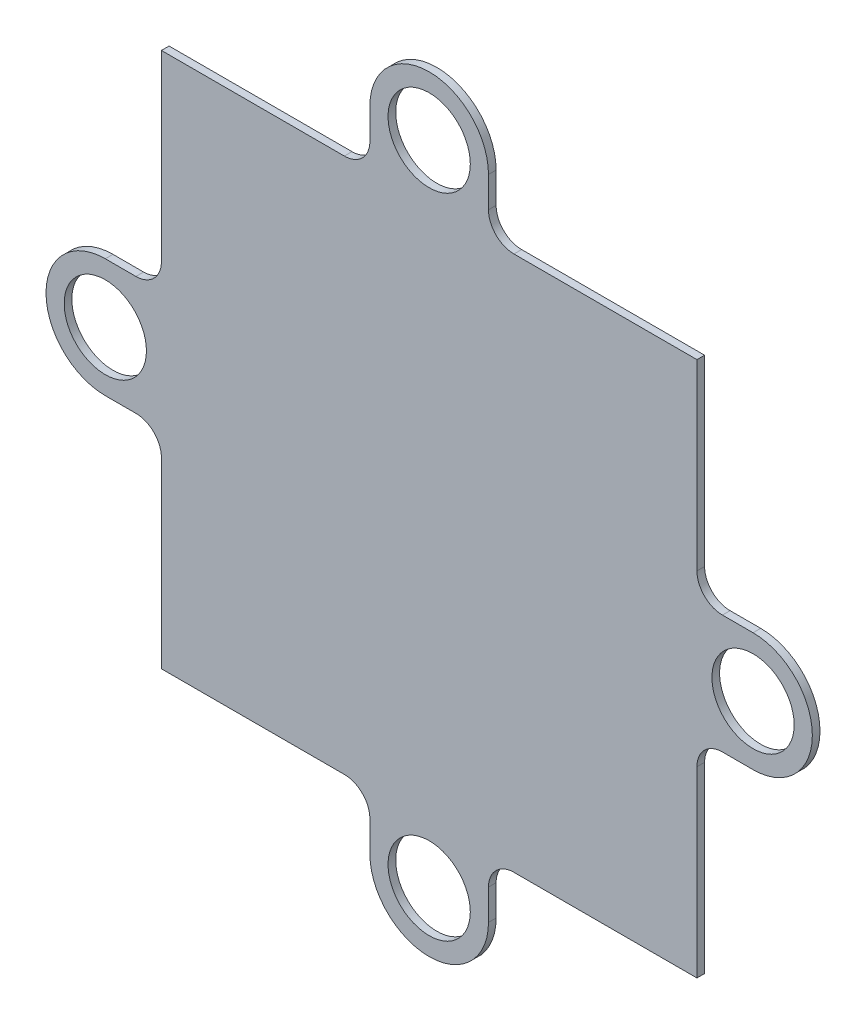
ISO-10303-21;
HEADER;
FILE_DESCRIPTION(('STEP AP214'),'2;1');
FILE_NAME('part.step','',(''),(''),'','','');
FILE_SCHEMA(('AUTOMOTIVE_DESIGN { 1 0 10303 214 1 1 1 1 }'));
ENDSEC;
DATA;
#1=APPLICATION_CONTEXT('core data for automotive mechanical design processes');
#2=APPLICATION_PROTOCOL_DEFINITION('international standard','automotive_design',2000,#1);
#3=PRODUCT_CONTEXT('',#1,'mechanical');
#4=PRODUCT('Part','Part','',(#3));
#5=PRODUCT_RELATED_PRODUCT_CATEGORY('part','',(#4));
#6=PRODUCT_DEFINITION_FORMATION('','',#4);
#7=PRODUCT_DEFINITION_CONTEXT('part definition',#1,'design');
#8=PRODUCT_DEFINITION('design','',#6,#7);
#9=PRODUCT_DEFINITION_SHAPE('','',#8);
#10=(LENGTH_UNIT() NAMED_UNIT(*) SI_UNIT(.MILLI.,.METRE.));
#11=(NAMED_UNIT(*) PLANE_ANGLE_UNIT() SI_UNIT($,.RADIAN.));
#12=(NAMED_UNIT(*) SI_UNIT($,.STERADIAN.) SOLID_ANGLE_UNIT());
#13=UNCERTAINTY_MEASURE_WITH_UNIT(LENGTH_MEASURE(1.E-05),#10,'distance_accuracy_value','');
#14=(GEOMETRIC_REPRESENTATION_CONTEXT(3) GLOBAL_UNCERTAINTY_ASSIGNED_CONTEXT((#13)) GLOBAL_UNIT_ASSIGNED_CONTEXT((#10,
#11,#12)) REPRESENTATION_CONTEXT('',''));
#15=CARTESIAN_POINT('',(0.,0.,0.));
#16=DIRECTION('',(0.,0.,1.));
#17=DIRECTION('',(1.,0.,0.));
#18=AXIS2_PLACEMENT_3D('',#15,#16,#17);
#19=CARTESIAN_POINT('',(0.,-4.64999999999974,0.6));
#20=DIRECTION('',(0.,1.,0.));
#21=DIRECTION('',(0.,0.,1.));
#22=AXIS2_PLACEMENT_3D('',#19,#20,#21);
#23=PLANE('',#22);
#24=DIRECTION('',(1.,0.,0.));
#25=VECTOR('',#24,1.);
#26=CARTESIAN_POINT('',(0.,-4.64999999999974,0.));
#27=LINE('',#26,#25);
#28=CARTESIAN_POINT('',(-25.4000000000001,-4.64999999999974,0.));
#29=VERTEX_POINT('',#28);
#30=CARTESIAN_POINT('',(-23.0000000000001,-4.64999999999974,0.));
#31=VERTEX_POINT('',#30);
#32=EDGE_CURVE('E282',#29,#31,#27,.T.);
#33=ORIENTED_EDGE('',*,*,#32,.T.);
#34=DIRECTION('',(0.,0.,-1.));
#35=VECTOR('',#34,1.);
#36=CARTESIAN_POINT('',(-23.0000000000001,-4.64999999999974,0.6));
#37=LINE('',#36,#35);
#38=CARTESIAN_POINT('',(-23.0000000000001,-4.64999999999974,0.6));
#39=VERTEX_POINT('',#38);
#40=EDGE_CURVE('E11',#39,#31,#37,.T.);
#41=ORIENTED_EDGE('',*,*,#40,.F.);
#42=DIRECTION('',(1.,0.,0.));
#43=VECTOR('',#42,1.);
#44=CARTESIAN_POINT('',(0.,-4.64999999999974,0.6));
#45=LINE('',#44,#43);
#46=CARTESIAN_POINT('',(-25.4000000000001,-4.64999999999974,0.6));
#47=VERTEX_POINT('',#46);
#48=EDGE_CURVE('E488',#47,#39,#45,.T.);
#49=ORIENTED_EDGE('',*,*,#48,.F.);
#50=DIRECTION('',(0.,0.,-1.));
#51=VECTOR('',#50,1.);
#52=CARTESIAN_POINT('',(-25.4000000000001,-4.64999999999974,0.6));
#53=LINE('',#52,#51);
#54=EDGE_CURVE('E262',#47,#29,#53,.T.);
#55=ORIENTED_EDGE('',*,*,#54,.T.);
#56=EDGE_LOOP('',(#33,#41,#49,#55));
#57=FACE_BOUND('',#56,.T.);
#58=ADVANCED_FACE('F45',(#57),#23,.F.);
#59=CARTESIAN_POINT('',(-23.0000000000001,-6.64999999999976,0.6));
#60=DIRECTION('',(0.,0.,-1.));
#61=DIRECTION('',(-1.,0.,0.));
#62=AXIS2_PLACEMENT_3D('',#59,#60,#61);
#63=CYLINDRICAL_SURFACE('',#62,2.00000000000001);
#64=CARTESIAN_POINT('',(-23.0000000000001,-6.64999999999976,0.));
#65=DIRECTION('',(0.,0.,1.));
#66=DIRECTION('',(1.,0.,0.));
#67=AXIS2_PLACEMENT_3D('',#64,#65,#66);
#68=CIRCLE('',#67,2.00000000000001);
#69=CARTESIAN_POINT('',(-21.0000000000001,-6.6499999999998,0.));
#70=VERTEX_POINT('',#69);
#71=EDGE_CURVE('E286',#31,#70,#68,.F.);
#72=ORIENTED_EDGE('',*,*,#71,.T.);
#73=DIRECTION('',(0.,0.,-1.));
#74=VECTOR('',#73,1.);
#75=CARTESIAN_POINT('',(-21.0000000000001,-6.6499999999998,0.6));
#76=LINE('',#75,#74);
#77=CARTESIAN_POINT('',(-21.0000000000001,-6.6499999999998,0.6));
#78=VERTEX_POINT('',#77);
#79=EDGE_CURVE('E55',#78,#70,#76,.T.);
#80=ORIENTED_EDGE('',*,*,#79,.F.);
#81=CARTESIAN_POINT('',(-23.0000000000001,-6.64999999999976,0.6));
#82=DIRECTION('',(0.,0.,1.));
#83=DIRECTION('',(1.,0.,0.));
#84=AXIS2_PLACEMENT_3D('',#81,#82,#83);
#85=CIRCLE('',#84,2.00000000000001);
#86=EDGE_CURVE('E162',#39,#78,#85,.F.);
#87=ORIENTED_EDGE('',*,*,#86,.F.);
#88=ORIENTED_EDGE('',*,*,#40,.T.);
#89=EDGE_LOOP('',(#72,#80,#87,#88));
#90=FACE_BOUND('',#89,.T.);
#91=ADVANCED_FACE('F468',(#90),#63,.F.);
#92=CARTESIAN_POINT('',(-21.0000000000001,-1.01544788837666E-13,0.6));
#93=DIRECTION('',(-1.,0.,0.));
#94=DIRECTION('',(0.,-1.,0.));
#95=AXIS2_PLACEMENT_3D('',#92,#93,#94);
#96=PLANE('',#95);
#97=DIRECTION('',(0.,1.,0.));
#98=VECTOR('',#97,1.);
#99=CARTESIAN_POINT('',(-21.0000000000001,-1.01544788837666E-13,0.));
#100=LINE('',#99,#98);
#101=CARTESIAN_POINT('',(-21.,-21.,0.));
#102=VERTEX_POINT('',#101);
#103=EDGE_CURVE('E290',#102,#70,#100,.T.);
#104=ORIENTED_EDGE('',*,*,#103,.F.);
#105=DIRECTION('',(0.,0.,-1.));
#106=VECTOR('',#105,1.);
#107=CARTESIAN_POINT('',(-21.,-21.,0.6));
#108=LINE('',#107,#106);
#109=CARTESIAN_POINT('',(-21.,-21.,0.6));
#110=VERTEX_POINT('',#109);
#111=EDGE_CURVE('E459',#110,#102,#108,.T.);
#112=ORIENTED_EDGE('',*,*,#111,.F.);
#113=DIRECTION('',(0.,1.,0.));
#114=VECTOR('',#113,1.);
#115=CARTESIAN_POINT('',(-21.0000000000001,-1.01544788837666E-13,0.6));
#116=LINE('',#115,#114);
#117=EDGE_CURVE('E467',#110,#78,#116,.T.);
#118=ORIENTED_EDGE('',*,*,#117,.T.);
#119=ORIENTED_EDGE('',*,*,#79,.T.);
#120=EDGE_LOOP('',(#104,#112,#118,#119));
#121=FACE_BOUND('',#120,.T.);
#122=ADVANCED_FACE('F465',(#121),#96,.T.);
#123=CARTESIAN_POINT('',(1.827806199078E-13,-20.9999999999998,0.6));
#124=DIRECTION('',(0.,1.,0.));
#125=DIRECTION('',(-1.,0.,0.));
#126=AXIS2_PLACEMENT_3D('',#123,#124,#125);
#127=PLANE('',#126);
#128=DIRECTION('',(1.,0.,0.));
#129=VECTOR('',#128,1.);
#130=CARTESIAN_POINT('',(1.827806199078E-13,-20.9999999999998,0.));
#131=LINE('',#130,#129);
#132=CARTESIAN_POINT('',(-6.65000000000012,-20.9999999999999,0.));
#133=VERTEX_POINT('',#132);
#134=EDGE_CURVE('E294',#102,#133,#131,.T.);
#135=ORIENTED_EDGE('',*,*,#134,.T.);
#136=DIRECTION('',(0.,0.,-1.));
#137=VECTOR('',#136,1.);
#138=CARTESIAN_POINT('',(-6.65000000000012,-20.9999999999999,0.6));
#139=LINE('',#138,#137);
#140=CARTESIAN_POINT('',(-6.65000000000012,-20.9999999999999,0.6));
#141=VERTEX_POINT('',#140);
#142=EDGE_CURVE('E456',#141,#133,#139,.T.);
#143=ORIENTED_EDGE('',*,*,#142,.F.);
#144=DIRECTION('',(1.,0.,0.));
#145=VECTOR('',#144,1.);
#146=CARTESIAN_POINT('',(1.827806199078E-13,-20.9999999999998,0.6));
#147=LINE('',#146,#145);
#148=EDGE_CURVE('E480',#110,#141,#147,.T.);
#149=ORIENTED_EDGE('',*,*,#148,.F.);
#150=ORIENTED_EDGE('',*,*,#111,.T.);
#151=EDGE_LOOP('',(#135,#143,#149,#150));
#152=FACE_BOUND('',#151,.T.);
#153=ADVANCED_FACE('F477',(#152),#127,.F.);
#154=CARTESIAN_POINT('',(-6.65000000000008,-22.9999999999999,0.6));
#155=DIRECTION('',(0.,0.,-1.));
#156=DIRECTION('',(-1.,0.,0.));
#157=AXIS2_PLACEMENT_3D('',#154,#155,#156);
#158=CYLINDRICAL_SURFACE('',#157,2.);
#159=CARTESIAN_POINT('',(-6.65000000000008,-22.9999999999999,0.));
#160=DIRECTION('',(0.,0.,1.));
#161=DIRECTION('',(1.,0.,0.));
#162=AXIS2_PLACEMENT_3D('',#159,#160,#161);
#163=CIRCLE('',#162,2.);
#164=CARTESIAN_POINT('',(-4.65000000000009,-22.9999999999999,0.));
#165=VERTEX_POINT('',#164);
#166=EDGE_CURVE('E298',#165,#133,#163,.T.);
#167=ORIENTED_EDGE('',*,*,#166,.F.);
#168=DIRECTION('',(0.,0.,-1.));
#169=VECTOR('',#168,1.);
#170=CARTESIAN_POINT('',(-4.65000000000009,-22.9999999999999,0.6));
#171=LINE('',#170,#169);
#172=CARTESIAN_POINT('',(-4.65000000000009,-22.9999999999999,0.6));
#173=VERTEX_POINT('',#172);
#174=EDGE_CURVE('E453',#173,#165,#171,.T.);
#175=ORIENTED_EDGE('',*,*,#174,.F.);
#176=CARTESIAN_POINT('',(-6.65000000000008,-22.9999999999999,0.6));
#177=DIRECTION('',(0.,0.,1.));
#178=DIRECTION('',(1.,0.,0.));
#179=AXIS2_PLACEMENT_3D('',#176,#177,#178);
#180=CIRCLE('',#179,2.);
#181=EDGE_CURVE('E483',#173,#141,#180,.T.);
#182=ORIENTED_EDGE('',*,*,#181,.T.);
#183=ORIENTED_EDGE('',*,*,#142,.T.);
#184=EDGE_LOOP('',(#167,#175,#182,#183));
#185=FACE_BOUND('',#184,.T.);
#186=ADVANCED_FACE('F841',(#185),#158,.F.);
#187=CARTESIAN_POINT('',(-4.65000000000009,0.,0.6));
#188=DIRECTION('',(-1.,0.,0.));
#189=DIRECTION('',(0.,0.,1.));
#190=AXIS2_PLACEMENT_3D('',#187,#188,#189);
#191=PLANE('',#190);
#192=DIRECTION('',(0.,1.,0.));
#193=VECTOR('',#192,1.);
#194=CARTESIAN_POINT('',(-4.65000000000009,0.,0.));
#195=LINE('',#194,#193);
#196=CARTESIAN_POINT('',(-4.65000000000009,-25.4,0.));
#197=VERTEX_POINT('',#196);
#198=EDGE_CURVE('E302',#197,#165,#195,.T.);
#199=ORIENTED_EDGE('',*,*,#198,.F.);
#200=DIRECTION('',(0.,0.,-1.));
#201=VECTOR('',#200,1.);
#202=CARTESIAN_POINT('',(-4.65000000000009,-25.4,0.6));
#203=LINE('',#202,#201);
#204=CARTESIAN_POINT('',(-4.65000000000009,-25.4,0.6));
#205=VERTEX_POINT('',#204);
#206=EDGE_CURVE('E450',#205,#197,#203,.T.);
#207=ORIENTED_EDGE('',*,*,#206,.F.);
#208=DIRECTION('',(0.,1.,0.));
#209=VECTOR('',#208,1.);
#210=CARTESIAN_POINT('',(-4.65000000000009,0.,0.6));
#211=LINE('',#210,#209);
#212=EDGE_CURVE('E494',#205,#173,#211,.T.);
#213=ORIENTED_EDGE('',*,*,#212,.T.);
#214=ORIENTED_EDGE('',*,*,#174,.T.);
#215=EDGE_LOOP('',(#199,#207,#213,#214));
#216=FACE_BOUND('',#215,.T.);
#217=ADVANCED_FACE('F832',(#216),#191,.T.);
#218=CARTESIAN_POINT('',(0.,-25.4,0.6));
#219=DIRECTION('',(0.,0.,-1.));
#220=DIRECTION('',(-1.,0.,0.));
#221=AXIS2_PLACEMENT_3D('',#218,#219,#220);
#222=CYLINDRICAL_SURFACE('',#221,4.65);
#223=CARTESIAN_POINT('',(0.,-25.4,0.));
#224=DIRECTION('',(0.,0.,1.));
#225=DIRECTION('',(1.,0.,0.));
#226=AXIS2_PLACEMENT_3D('',#223,#224,#225);
#227=CIRCLE('',#226,4.65);
#228=CARTESIAN_POINT('',(4.64999999999991,-25.4,0.));
#229=VERTEX_POINT('',#228);
#230=EDGE_CURVE('E306',#197,#229,#227,.T.);
#231=ORIENTED_EDGE('',*,*,#230,.T.);
#232=DIRECTION('',(0.,0.,-1.));
#233=VECTOR('',#232,1.);
#234=CARTESIAN_POINT('',(4.64999999999991,-25.4,0.6));
#235=LINE('',#234,#233);
#236=CARTESIAN_POINT('',(4.64999999999991,-25.4,0.6));
#237=VERTEX_POINT('',#236);
#238=EDGE_CURVE('E446',#237,#229,#235,.T.);
#239=ORIENTED_EDGE('',*,*,#238,.F.);
#240=CARTESIAN_POINT('',(0.,-25.4,0.6));
#241=DIRECTION('',(0.,0.,1.));
#242=DIRECTION('',(1.,0.,0.));
#243=AXIS2_PLACEMENT_3D('',#240,#241,#242);
#244=CIRCLE('',#243,4.65);
#245=EDGE_CURVE('E498',#205,#237,#244,.T.);
#246=ORIENTED_EDGE('',*,*,#245,.F.);
#247=ORIENTED_EDGE('',*,*,#206,.T.);
#248=EDGE_LOOP('',(#231,#239,#246,#247));
#249=FACE_BOUND('',#248,.T.);
#250=ADVANCED_FACE('F823',(#249),#222,.T.);
#251=CARTESIAN_POINT('',(4.64999999999991,0.,0.6));
#252=DIRECTION('',(-1.,0.,0.));
#253=DIRECTION('',(0.,0.,1.));
#254=AXIS2_PLACEMENT_3D('',#251,#252,#253);
#255=PLANE('',#254);
#256=DIRECTION('',(0.,1.,0.));
#257=VECTOR('',#256,1.);
#258=CARTESIAN_POINT('',(4.64999999999991,0.,0.));
#259=LINE('',#258,#257);
#260=CARTESIAN_POINT('',(4.64999999999991,-22.9999999999999,0.));
#261=VERTEX_POINT('',#260);
#262=EDGE_CURVE('E309',#229,#261,#259,.T.);
#263=ORIENTED_EDGE('',*,*,#262,.T.);
#264=DIRECTION('',(0.,0.,-1.));
#265=VECTOR('',#264,1.);
#266=CARTESIAN_POINT('',(4.64999999999991,-22.9999999999999,0.6));
#267=LINE('',#266,#265);
#268=CARTESIAN_POINT('',(4.64999999999991,-22.9999999999999,0.6));
#269=VERTEX_POINT('',#268);
#270=EDGE_CURVE('E442',#269,#261,#267,.T.);
#271=ORIENTED_EDGE('',*,*,#270,.F.);
#272=DIRECTION('',(0.,1.,0.));
#273=VECTOR('',#272,1.);
#274=CARTESIAN_POINT('',(4.64999999999991,0.,0.6));
#275=LINE('',#274,#273);
#276=EDGE_CURVE('E501',#237,#269,#275,.T.);
#277=ORIENTED_EDGE('',*,*,#276,.F.);
#278=ORIENTED_EDGE('',*,*,#238,.T.);
#279=EDGE_LOOP('',(#263,#271,#277,#278));
#280=FACE_BOUND('',#279,.T.);
#281=ADVANCED_FACE('F814',(#280),#255,.F.);
#282=CARTESIAN_POINT('',(6.6499999999999,-22.9999999999999,0.6));
#283=DIRECTION('',(0.,0.,-1.));
#284=DIRECTION('',(-1.,0.,0.));
#285=AXIS2_PLACEMENT_3D('',#282,#283,#284);
#286=CYLINDRICAL_SURFACE('',#285,2.);
#287=CARTESIAN_POINT('',(6.6499999999999,-22.9999999999999,0.));
#288=DIRECTION('',(0.,0.,1.));
#289=DIRECTION('',(1.,0.,0.));
#290=AXIS2_PLACEMENT_3D('',#287,#288,#289);
#291=CIRCLE('',#290,2.);
#292=CARTESIAN_POINT('',(6.64999999999994,-20.9999999999999,0.));
#293=VERTEX_POINT('',#292);
#294=EDGE_CURVE('E312',#261,#293,#291,.F.);
#295=ORIENTED_EDGE('',*,*,#294,.T.);
#296=DIRECTION('',(0.,0.,-1.));
#297=VECTOR('',#296,1.);
#298=CARTESIAN_POINT('',(6.64999999999994,-20.9999999999999,0.6));
#299=LINE('',#298,#297);
#300=CARTESIAN_POINT('',(6.64999999999994,-20.9999999999999,0.6));
#301=VERTEX_POINT('',#300);
#302=EDGE_CURVE('E438',#301,#293,#299,.T.);
#303=ORIENTED_EDGE('',*,*,#302,.F.);
#304=CARTESIAN_POINT('',(6.6499999999999,-22.9999999999999,0.6));
#305=DIRECTION('',(0.,0.,1.));
#306=DIRECTION('',(1.,0.,0.));
#307=AXIS2_PLACEMENT_3D('',#304,#305,#306);
#308=CIRCLE('',#307,2.);
#309=EDGE_CURVE('E504',#269,#301,#308,.F.);
#310=ORIENTED_EDGE('',*,*,#309,.F.);
#311=ORIENTED_EDGE('',*,*,#270,.T.);
#312=EDGE_LOOP('',(#295,#303,#310,#311));
#313=FACE_BOUND('',#312,.T.);
#314=ADVANCED_FACE('F805',(#313),#286,.F.);
#315=CARTESIAN_POINT('',(0.,-20.9999999999999,0.6));
#316=DIRECTION('',(0.,1.,0.));
#317=DIRECTION('',(0.,0.,1.));
#318=AXIS2_PLACEMENT_3D('',#315,#316,#317);
#319=PLANE('',#318);
#320=DIRECTION('',(1.,0.,0.));
#321=VECTOR('',#320,1.);
#322=CARTESIAN_POINT('',(0.,-20.9999999999999,0.));
#323=LINE('',#322,#321);
#324=CARTESIAN_POINT('',(21.,-21.,0.));
#325=VERTEX_POINT('',#324);
#326=EDGE_CURVE('E315',#293,#325,#323,.T.);
#327=ORIENTED_EDGE('',*,*,#326,.T.);
#328=DIRECTION('',(0.,0.,-1.));
#329=VECTOR('',#328,1.);
#330=CARTESIAN_POINT('',(21.,-21.,0.6));
#331=LINE('',#330,#329);
#332=CARTESIAN_POINT('',(21.,-21.,0.6));
#333=VERTEX_POINT('',#332);
#334=EDGE_CURVE('E434',#333,#325,#331,.T.);
#335=ORIENTED_EDGE('',*,*,#334,.F.);
#336=DIRECTION('',(1.,0.,0.));
#337=VECTOR('',#336,1.);
#338=CARTESIAN_POINT('',(0.,-20.9999999999999,0.6));
#339=LINE('',#338,#337);
#340=EDGE_CURVE('E507',#301,#333,#339,.T.);
#341=ORIENTED_EDGE('',*,*,#340,.F.);
#342=ORIENTED_EDGE('',*,*,#302,.T.);
#343=EDGE_LOOP('',(#327,#335,#341,#342));
#344=FACE_BOUND('',#343,.T.);
#345=ADVANCED_FACE('F796',(#344),#319,.F.);
#346=CARTESIAN_POINT('',(21.,0.,0.6));
#347=DIRECTION('',(-1.,0.,0.));
#348=DIRECTION('',(0.,-1.,0.));
#349=AXIS2_PLACEMENT_3D('',#346,#347,#348);
#350=PLANE('',#349);
#351=DIRECTION('',(0.,1.,0.));
#352=VECTOR('',#351,1.);
#353=CARTESIAN_POINT('',(21.,0.,0.));
#354=LINE('',#353,#352);
#355=CARTESIAN_POINT('',(21.,-6.6500000000001,0.));
#356=VERTEX_POINT('',#355);
#357=EDGE_CURVE('E318',#325,#356,#354,.T.);
#358=ORIENTED_EDGE('',*,*,#357,.T.);
#359=DIRECTION('',(0.,0.,-1.));
#360=VECTOR('',#359,1.);
#361=CARTESIAN_POINT('',(21.,-6.6500000000001,0.6));
#362=LINE('',#361,#360);
#363=CARTESIAN_POINT('',(21.,-6.6500000000001,0.6));
#364=VERTEX_POINT('',#363);
#365=EDGE_CURVE('E431',#364,#356,#362,.T.);
#366=ORIENTED_EDGE('',*,*,#365,.F.);
#367=DIRECTION('',(0.,1.,0.));
#368=VECTOR('',#367,1.);
#369=CARTESIAN_POINT('',(21.,0.,0.6));
#370=LINE('',#369,#368);
#371=EDGE_CURVE('E510',#333,#364,#370,.T.);
#372=ORIENTED_EDGE('',*,*,#371,.F.);
#373=ORIENTED_EDGE('',*,*,#334,.T.);
#374=EDGE_LOOP('',(#358,#366,#372,#373));
#375=FACE_BOUND('',#374,.T.);
#376=ADVANCED_FACE('F787',(#375),#350,.F.);
#377=CARTESIAN_POINT('',(23.,-6.65000000000009,0.6));
#378=DIRECTION('',(0.,0.,-1.));
#379=DIRECTION('',(-1.,0.,0.));
#380=AXIS2_PLACEMENT_3D('',#377,#378,#379);
#381=CYLINDRICAL_SURFACE('',#380,2.);
#382=CARTESIAN_POINT('',(23.,-6.65000000000009,0.));
#383=DIRECTION('',(0.,0.,1.));
#384=DIRECTION('',(1.,0.,0.));
#385=AXIS2_PLACEMENT_3D('',#382,#383,#384);
#386=CIRCLE('',#385,2.);
#387=CARTESIAN_POINT('',(23.,-4.6500000000001,0.));
#388=VERTEX_POINT('',#387);
#389=EDGE_CURVE('E322',#388,#356,#386,.T.);
#390=ORIENTED_EDGE('',*,*,#389,.F.);
#391=DIRECTION('',(0.,0.,-1.));
#392=VECTOR('',#391,1.);
#393=CARTESIAN_POINT('',(23.,-4.6500000000001,0.6));
#394=LINE('',#393,#392);
#395=CARTESIAN_POINT('',(23.,-4.6500000000001,0.6));
#396=VERTEX_POINT('',#395);
#397=EDGE_CURVE('E428',#396,#388,#394,.T.);
#398=ORIENTED_EDGE('',*,*,#397,.F.);
#399=CARTESIAN_POINT('',(23.,-6.65000000000009,0.6));
#400=DIRECTION('',(0.,0.,1.));
#401=DIRECTION('',(1.,0.,0.));
#402=AXIS2_PLACEMENT_3D('',#399,#400,#401);
#403=CIRCLE('',#402,2.);
#404=EDGE_CURVE('E513',#396,#364,#403,.T.);
#405=ORIENTED_EDGE('',*,*,#404,.T.);
#406=ORIENTED_EDGE('',*,*,#365,.T.);
#407=EDGE_LOOP('',(#390,#398,#405,#406));
#408=FACE_BOUND('',#407,.T.);
#409=ADVANCED_FACE('F778',(#408),#381,.F.);
#410=CARTESIAN_POINT('',(0.,-4.6500000000001,0.6));
#411=DIRECTION('',(0.,-1.,0.));
#412=DIRECTION('',(0.,0.,-1.));
#413=AXIS2_PLACEMENT_3D('',#410,#411,#412);
#414=PLANE('',#413);
#415=DIRECTION('',(-1.,0.,0.));
#416=VECTOR('',#415,1.);
#417=CARTESIAN_POINT('',(0.,-4.6500000000001,0.));
#418=LINE('',#417,#416);
#419=CARTESIAN_POINT('',(25.4000000000001,-4.6500000000001,0.));
#420=VERTEX_POINT('',#419);
#421=EDGE_CURVE('E326',#420,#388,#418,.T.);
#422=ORIENTED_EDGE('',*,*,#421,.F.);
#423=DIRECTION('',(0.,0.,-1.));
#424=VECTOR('',#423,1.);
#425=CARTESIAN_POINT('',(25.4000000000001,-4.6500000000001,0.6));
#426=LINE('',#425,#424);
#427=CARTESIAN_POINT('',(25.4000000000001,-4.6500000000001,0.6));
#428=VERTEX_POINT('',#427);
#429=EDGE_CURVE('E425',#428,#420,#426,.T.);
#430=ORIENTED_EDGE('',*,*,#429,.F.);
#431=DIRECTION('',(-1.,0.,0.));
#432=VECTOR('',#431,1.);
#433=CARTESIAN_POINT('',(0.,-4.6500000000001,0.6));
#434=LINE('',#433,#432);
#435=EDGE_CURVE('E517',#428,#396,#434,.T.);
#436=ORIENTED_EDGE('',*,*,#435,.T.);
#437=ORIENTED_EDGE('',*,*,#397,.T.);
#438=EDGE_LOOP('',(#422,#430,#436,#437));
#439=FACE_BOUND('',#438,.T.);
#440=ADVANCED_FACE('F769',(#439),#414,.T.);
#441=CARTESIAN_POINT('',(25.4000000000001,0.,0.6));
#442=DIRECTION('',(0.,0.,-1.));
#443=DIRECTION('',(-1.,0.,0.));
#444=AXIS2_PLACEMENT_3D('',#441,#442,#443);
#445=CYLINDRICAL_SURFACE('',#444,4.65);
#446=CARTESIAN_POINT('',(25.4000000000001,0.,0.));
#447=DIRECTION('',(0.,0.,1.));
#448=DIRECTION('',(1.,0.,0.));
#449=AXIS2_PLACEMENT_3D('',#446,#447,#448);
#450=CIRCLE('',#449,4.65);
#451=CARTESIAN_POINT('',(25.4000000000001,4.6499999999999,0.));
#452=VERTEX_POINT('',#451);
#453=EDGE_CURVE('E330',#420,#452,#450,.T.);
#454=ORIENTED_EDGE('',*,*,#453,.T.);
#455=DIRECTION('',(0.,0.,-1.));
#456=VECTOR('',#455,1.);
#457=CARTESIAN_POINT('',(25.4000000000001,4.6499999999999,0.6));
#458=LINE('',#457,#456);
#459=CARTESIAN_POINT('',(25.4000000000001,4.6499999999999,0.6));
#460=VERTEX_POINT('',#459);
#461=EDGE_CURVE('E421',#460,#452,#458,.T.);
#462=ORIENTED_EDGE('',*,*,#461,.F.);
#463=CARTESIAN_POINT('',(25.4000000000001,0.,0.6));
#464=DIRECTION('',(0.,0.,1.));
#465=DIRECTION('',(1.,0.,0.));
#466=AXIS2_PLACEMENT_3D('',#463,#464,#465);
#467=CIRCLE('',#466,4.65);
#468=EDGE_CURVE('E521',#428,#460,#467,.T.);
#469=ORIENTED_EDGE('',*,*,#468,.F.);
#470=ORIENTED_EDGE('',*,*,#429,.T.);
#471=EDGE_LOOP('',(#454,#462,#469,#470));
#472=FACE_BOUND('',#471,.T.);
#473=ADVANCED_FACE('F760',(#472),#445,.T.);
#474=CARTESIAN_POINT('',(0.,4.6499999999999,0.6));
#475=DIRECTION('',(0.,-1.,0.));
#476=DIRECTION('',(0.,0.,-1.));
#477=AXIS2_PLACEMENT_3D('',#474,#475,#476);
#478=PLANE('',#477);
#479=DIRECTION('',(-1.,0.,0.));
#480=VECTOR('',#479,1.);
#481=CARTESIAN_POINT('',(0.,4.6499999999999,0.));
#482=LINE('',#481,#480);
#483=CARTESIAN_POINT('',(23.,4.6499999999999,0.));
#484=VERTEX_POINT('',#483);
#485=EDGE_CURVE('E333',#452,#484,#482,.T.);
#486=ORIENTED_EDGE('',*,*,#485,.T.);
#487=DIRECTION('',(0.,0.,-1.));
#488=VECTOR('',#487,1.);
#489=CARTESIAN_POINT('',(23.,4.6499999999999,0.6));
#490=LINE('',#489,#488);
#491=CARTESIAN_POINT('',(23.,4.6499999999999,0.6));
#492=VERTEX_POINT('',#491);
#493=EDGE_CURVE('E417',#492,#484,#490,.T.);
#494=ORIENTED_EDGE('',*,*,#493,.F.);
#495=DIRECTION('',(-1.,0.,0.));
#496=VECTOR('',#495,1.);
#497=CARTESIAN_POINT('',(0.,4.6499999999999,0.6));
#498=LINE('',#497,#496);
#499=EDGE_CURVE('E524',#460,#492,#498,.T.);
#500=ORIENTED_EDGE('',*,*,#499,.F.);
#501=ORIENTED_EDGE('',*,*,#461,.T.);
#502=EDGE_LOOP('',(#486,#494,#500,#501));
#503=FACE_BOUND('',#502,.T.);
#504=ADVANCED_FACE('F751',(#503),#478,.F.);
#505=CARTESIAN_POINT('',(23.,6.64999999999991,0.6));
#506=DIRECTION('',(0.,0.,-1.));
#507=DIRECTION('',(-1.,0.,0.));
#508=AXIS2_PLACEMENT_3D('',#505,#506,#507);
#509=CYLINDRICAL_SURFACE('',#508,2.00000000000001);
#510=CARTESIAN_POINT('',(23.,6.64999999999991,0.));
#511=DIRECTION('',(0.,0.,1.));
#512=DIRECTION('',(1.,0.,0.));
#513=AXIS2_PLACEMENT_3D('',#510,#511,#512);
#514=CIRCLE('',#513,2.00000000000001);
#515=CARTESIAN_POINT('',(21.,6.64999999999993,0.));
#516=VERTEX_POINT('',#515);
#517=EDGE_CURVE('E336',#484,#516,#514,.F.);
#518=ORIENTED_EDGE('',*,*,#517,.T.);
#519=DIRECTION('',(0.,0.,-1.));
#520=VECTOR('',#519,1.);
#521=CARTESIAN_POINT('',(21.,6.64999999999993,0.6));
#522=LINE('',#521,#520);
#523=CARTESIAN_POINT('',(21.,6.64999999999993,0.6));
#524=VERTEX_POINT('',#523);
#525=EDGE_CURVE('E413',#524,#516,#522,.T.);
#526=ORIENTED_EDGE('',*,*,#525,.F.);
#527=CARTESIAN_POINT('',(23.,6.64999999999991,0.6));
#528=DIRECTION('',(0.,0.,1.));
#529=DIRECTION('',(1.,0.,0.));
#530=AXIS2_PLACEMENT_3D('',#527,#528,#529);
#531=CIRCLE('',#530,2.00000000000001);
#532=EDGE_CURVE('E527',#492,#524,#531,.F.);
#533=ORIENTED_EDGE('',*,*,#532,.F.);
#534=ORIENTED_EDGE('',*,*,#493,.T.);
#535=EDGE_LOOP('',(#518,#526,#533,#534));
#536=FACE_BOUND('',#535,.T.);
#537=ADVANCED_FACE('F742',(#536),#509,.F.);
#538=CARTESIAN_POINT('',(21.,0.,0.6));
#539=DIRECTION('',(-1.,0.,0.));
#540=DIRECTION('',(0.,0.,1.));
#541=AXIS2_PLACEMENT_3D('',#538,#539,#540);
#542=PLANE('',#541);
#543=DIRECTION('',(0.,1.,0.));
#544=VECTOR('',#543,1.);
#545=CARTESIAN_POINT('',(21.,0.,0.));
#546=LINE('',#545,#544);
#547=CARTESIAN_POINT('',(21.,21.,0.));
#548=VERTEX_POINT('',#547);
#549=EDGE_CURVE('E339',#516,#548,#546,.T.);
#550=ORIENTED_EDGE('',*,*,#549,.T.);
#551=DIRECTION('',(0.,0.,-1.));
#552=VECTOR('',#551,1.);
#553=CARTESIAN_POINT('',(21.,21.,0.6));
#554=LINE('',#553,#552);
#555=CARTESIAN_POINT('',(21.,21.,0.6));
#556=VERTEX_POINT('',#555);
#557=EDGE_CURVE('E410',#556,#548,#554,.T.);
#558=ORIENTED_EDGE('',*,*,#557,.F.);
#559=DIRECTION('',(0.,1.,0.));
#560=VECTOR('',#559,1.);
#561=CARTESIAN_POINT('',(21.,0.,0.6));
#562=LINE('',#561,#560);
#563=EDGE_CURVE('E530',#524,#556,#562,.T.);
#564=ORIENTED_EDGE('',*,*,#563,.F.);
#565=ORIENTED_EDGE('',*,*,#525,.T.);
#566=EDGE_LOOP('',(#550,#558,#564,#565));
#567=FACE_BOUND('',#566,.T.);
#568=ADVANCED_FACE('F733',(#567),#542,.F.);
#569=CARTESIAN_POINT('',(0.,21.,0.6));
#570=DIRECTION('',(0.,1.,0.));
#571=DIRECTION('',(0.,0.,1.));
#572=AXIS2_PLACEMENT_3D('',#569,#570,#571);
#573=PLANE('',#572);
#574=DIRECTION('',(1.,0.,0.));
#575=VECTOR('',#574,1.);
#576=CARTESIAN_POINT('',(0.,21.,0.));
#577=LINE('',#576,#575);
#578=CARTESIAN_POINT('',(6.65000000000001,21.,0.));
#579=VERTEX_POINT('',#578);
#580=EDGE_CURVE('E343',#579,#548,#577,.T.);
#581=ORIENTED_EDGE('',*,*,#580,.F.);
#582=DIRECTION('',(0.,0.,-1.));
#583=VECTOR('',#582,1.);
#584=CARTESIAN_POINT('',(6.65000000000001,21.,0.6));
#585=LINE('',#584,#583);
#586=CARTESIAN_POINT('',(6.65000000000001,21.,0.6));
#587=VERTEX_POINT('',#586);
#588=EDGE_CURVE('E407',#587,#579,#585,.T.);
#589=ORIENTED_EDGE('',*,*,#588,.F.);
#590=DIRECTION('',(1.,0.,0.));
#591=VECTOR('',#590,1.);
#592=CARTESIAN_POINT('',(0.,21.,0.6));
#593=LINE('',#592,#591);
#594=EDGE_CURVE('E533',#587,#556,#593,.T.);
#595=ORIENTED_EDGE('',*,*,#594,.T.);
#596=ORIENTED_EDGE('',*,*,#557,.T.);
#597=EDGE_LOOP('',(#581,#589,#595,#596));
#598=FACE_BOUND('',#597,.T.);
#599=ADVANCED_FACE('F724',(#598),#573,.T.);
#600=CARTESIAN_POINT('',(6.65000000000001,23.,0.6));
#601=DIRECTION('',(0.,0.,-1.));
#602=DIRECTION('',(-1.,0.,0.));
#603=AXIS2_PLACEMENT_3D('',#600,#601,#602);
#604=CYLINDRICAL_SURFACE('',#603,2.);
#605=CARTESIAN_POINT('',(6.65000000000001,23.,0.));
#606=DIRECTION('',(0.,0.,1.));
#607=DIRECTION('',(1.,0.,0.));
#608=AXIS2_PLACEMENT_3D('',#605,#606,#607);
#609=CIRCLE('',#608,2.);
#610=CARTESIAN_POINT('',(4.65,23.,0.));
#611=VERTEX_POINT('',#610);
#612=EDGE_CURVE('E347',#611,#579,#609,.T.);
#613=ORIENTED_EDGE('',*,*,#612,.F.);
#614=DIRECTION('',(0.,0.,-1.));
#615=VECTOR('',#614,1.);
#616=CARTESIAN_POINT('',(4.65,23.,0.6));
#617=LINE('',#616,#615);
#618=CARTESIAN_POINT('',(4.65,23.,0.6));
#619=VERTEX_POINT('',#618);
#620=EDGE_CURVE('E404',#619,#611,#617,.T.);
#621=ORIENTED_EDGE('',*,*,#620,.F.);
#622=CARTESIAN_POINT('',(6.65000000000001,23.,0.6));
#623=DIRECTION('',(0.,0.,1.));
#624=DIRECTION('',(1.,0.,0.));
#625=AXIS2_PLACEMENT_3D('',#622,#623,#624);
#626=CIRCLE('',#625,2.);
#627=EDGE_CURVE('E537',#619,#587,#626,.T.);
#628=ORIENTED_EDGE('',*,*,#627,.T.);
#629=ORIENTED_EDGE('',*,*,#588,.T.);
#630=EDGE_LOOP('',(#613,#621,#628,#629));
#631=FACE_BOUND('',#630,.T.);
#632=ADVANCED_FACE('F715',(#631),#604,.F.);
#633=CARTESIAN_POINT('',(4.65,0.,0.6));
#634=DIRECTION('',(1.,0.,0.));
#635=DIRECTION('',(0.,0.,-1.));
#636=AXIS2_PLACEMENT_3D('',#633,#634,#635);
#637=PLANE('',#636);
#638=DIRECTION('',(0.,-1.,0.));
#639=VECTOR('',#638,1.);
#640=CARTESIAN_POINT('',(4.65,0.,0.));
#641=LINE('',#640,#639);
#642=CARTESIAN_POINT('',(4.65,25.4000000000001,0.));
#643=VERTEX_POINT('',#642);
#644=EDGE_CURVE('E351',#643,#611,#641,.T.);
#645=ORIENTED_EDGE('',*,*,#644,.F.);
#646=DIRECTION('',(0.,0.,-1.));
#647=VECTOR('',#646,1.);
#648=CARTESIAN_POINT('',(4.65,25.4000000000001,0.6));
#649=LINE('',#648,#647);
#650=CARTESIAN_POINT('',(4.65,25.4000000000001,0.6));
#651=VERTEX_POINT('',#650);
#652=EDGE_CURVE('E401',#651,#643,#649,.T.);
#653=ORIENTED_EDGE('',*,*,#652,.F.);
#654=DIRECTION('',(0.,-1.,0.));
#655=VECTOR('',#654,1.);
#656=CARTESIAN_POINT('',(4.65,0.,0.6));
#657=LINE('',#656,#655);
#658=EDGE_CURVE('E541',#651,#619,#657,.T.);
#659=ORIENTED_EDGE('',*,*,#658,.T.);
#660=ORIENTED_EDGE('',*,*,#620,.T.);
#661=EDGE_LOOP('',(#645,#653,#659,#660));
#662=FACE_BOUND('',#661,.T.);
#663=ADVANCED_FACE('F706',(#662),#637,.T.);
#664=CARTESIAN_POINT('',(0.,25.4000000000001,0.6));
#665=DIRECTION('',(0.,0.,-1.));
#666=DIRECTION('',(-1.,0.,0.));
#667=AXIS2_PLACEMENT_3D('',#664,#665,#666);
#668=CYLINDRICAL_SURFACE('',#667,4.65);
#669=CARTESIAN_POINT('',(0.,25.4000000000001,0.));
#670=DIRECTION('',(0.,0.,1.));
#671=DIRECTION('',(1.,0.,0.));
#672=AXIS2_PLACEMENT_3D('',#669,#670,#671);
#673=CIRCLE('',#672,4.65);
#674=CARTESIAN_POINT('',(-4.65,25.4000000000001,0.));
#675=VERTEX_POINT('',#674);
#676=EDGE_CURVE('E355',#643,#675,#673,.T.);
#677=ORIENTED_EDGE('',*,*,#676,.T.);
#678=DIRECTION('',(0.,0.,-1.));
#679=VECTOR('',#678,1.);
#680=CARTESIAN_POINT('',(-4.65,25.4000000000001,0.6));
#681=LINE('',#680,#679);
#682=CARTESIAN_POINT('',(-4.65,25.4000000000001,0.6));
#683=VERTEX_POINT('',#682);
#684=EDGE_CURVE('E397',#683,#675,#681,.T.);
#685=ORIENTED_EDGE('',*,*,#684,.F.);
#686=CARTESIAN_POINT('',(0.,25.4000000000001,0.6));
#687=DIRECTION('',(0.,0.,1.));
#688=DIRECTION('',(1.,0.,0.));
#689=AXIS2_PLACEMENT_3D('',#686,#687,#688);
#690=CIRCLE('',#689,4.65);
#691=EDGE_CURVE('E545',#651,#683,#690,.T.);
#692=ORIENTED_EDGE('',*,*,#691,.F.);
#693=ORIENTED_EDGE('',*,*,#652,.T.);
#694=EDGE_LOOP('',(#677,#685,#692,#693));
#695=FACE_BOUND('',#694,.T.);
#696=ADVANCED_FACE('F697',(#695),#668,.T.);
#697=CARTESIAN_POINT('',(-4.65,0.,0.6));
#698=DIRECTION('',(1.,0.,0.));
#699=DIRECTION('',(0.,0.,-1.));
#700=AXIS2_PLACEMENT_3D('',#697,#698,#699);
#701=PLANE('',#700);
#702=DIRECTION('',(0.,-1.,0.));
#703=VECTOR('',#702,1.);
#704=CARTESIAN_POINT('',(-4.65,0.,0.));
#705=LINE('',#704,#703);
#706=CARTESIAN_POINT('',(-4.65,23.,0.));
#707=VERTEX_POINT('',#706);
#708=EDGE_CURVE('E358',#675,#707,#705,.T.);
#709=ORIENTED_EDGE('',*,*,#708,.T.);
#710=DIRECTION('',(0.,0.,-1.));
#711=VECTOR('',#710,1.);
#712=CARTESIAN_POINT('',(-4.65,23.,0.6));
#713=LINE('',#712,#711);
#714=CARTESIAN_POINT('',(-4.65,23.,0.6));
#715=VERTEX_POINT('',#714);
#716=EDGE_CURVE('E393',#715,#707,#713,.T.);
#717=ORIENTED_EDGE('',*,*,#716,.F.);
#718=DIRECTION('',(0.,-1.,0.));
#719=VECTOR('',#718,1.);
#720=CARTESIAN_POINT('',(-4.65,0.,0.6));
#721=LINE('',#720,#719);
#722=EDGE_CURVE('E548',#683,#715,#721,.T.);
#723=ORIENTED_EDGE('',*,*,#722,.F.);
#724=ORIENTED_EDGE('',*,*,#684,.T.);
#725=EDGE_LOOP('',(#709,#717,#723,#724));
#726=FACE_BOUND('',#725,.T.);
#727=ADVANCED_FACE('F688',(#726),#701,.F.);
#728=CARTESIAN_POINT('',(-6.65,23.,0.6));
#729=DIRECTION('',(0.,0.,-1.));
#730=DIRECTION('',(-1.,0.,0.));
#731=AXIS2_PLACEMENT_3D('',#728,#729,#730);
#732=CYLINDRICAL_SURFACE('',#731,2.);
#733=CARTESIAN_POINT('',(-6.65,23.,0.));
#734=DIRECTION('',(0.,0.,1.));
#735=DIRECTION('',(1.,0.,0.));
#736=AXIS2_PLACEMENT_3D('',#733,#734,#735);
#737=CIRCLE('',#736,2.);
#738=CARTESIAN_POINT('',(-6.65,21.,0.));
#739=VERTEX_POINT('',#738);
#740=EDGE_CURVE('E361',#707,#739,#737,.F.);
#741=ORIENTED_EDGE('',*,*,#740,.T.);
#742=DIRECTION('',(0.,0.,-1.));
#743=VECTOR('',#742,1.);
#744=CARTESIAN_POINT('',(-6.65,21.,0.6));
#745=LINE('',#744,#743);
#746=CARTESIAN_POINT('',(-6.65,21.,0.6));
#747=VERTEX_POINT('',#746);
#748=EDGE_CURVE('E390',#747,#739,#745,.T.);
#749=ORIENTED_EDGE('',*,*,#748,.F.);
#750=CARTESIAN_POINT('',(-6.65,23.,0.6));
#751=DIRECTION('',(0.,0.,1.));
#752=DIRECTION('',(1.,0.,0.));
#753=AXIS2_PLACEMENT_3D('',#750,#751,#752);
#754=CIRCLE('',#753,2.);
#755=EDGE_CURVE('E551',#715,#747,#754,.F.);
#756=ORIENTED_EDGE('',*,*,#755,.F.);
#757=ORIENTED_EDGE('',*,*,#716,.T.);
#758=EDGE_LOOP('',(#741,#749,#756,#757));
#759=FACE_BOUND('',#758,.T.);
#760=ADVANCED_FACE('F679',(#759),#732,.F.);
#761=CARTESIAN_POINT('',(0.,21.,0.6));
#762=DIRECTION('',(0.,1.,0.));
#763=DIRECTION('',(0.,0.,1.));
#764=AXIS2_PLACEMENT_3D('',#761,#762,#763);
#765=PLANE('',#764);
#766=DIRECTION('',(1.,0.,0.));
#767=VECTOR('',#766,1.);
#768=CARTESIAN_POINT('',(0.,21.,0.));
#769=LINE('',#768,#767);
#770=CARTESIAN_POINT('',(-21.,21.,0.));
#771=VERTEX_POINT('',#770);
#772=EDGE_CURVE('E365',#771,#739,#769,.T.);
#773=ORIENTED_EDGE('',*,*,#772,.F.);
#774=DIRECTION('',(0.,0.,-1.));
#775=VECTOR('',#774,1.);
#776=CARTESIAN_POINT('',(-21.,21.,0.6));
#777=LINE('',#776,#775);
#778=CARTESIAN_POINT('',(-21.,21.,0.6));
#779=VERTEX_POINT('',#778);
#780=EDGE_CURVE('E387',#779,#771,#777,.T.);
#781=ORIENTED_EDGE('',*,*,#780,.F.);
#782=DIRECTION('',(1.,0.,0.));
#783=VECTOR('',#782,1.);
#784=CARTESIAN_POINT('',(0.,21.,0.6));
#785=LINE('',#784,#783);
#786=EDGE_CURVE('E554',#779,#747,#785,.T.);
#787=ORIENTED_EDGE('',*,*,#786,.T.);
#788=ORIENTED_EDGE('',*,*,#748,.T.);
#789=EDGE_LOOP('',(#773,#781,#787,#788));
#790=FACE_BOUND('',#789,.T.);
#791=ADVANCED_FACE('F670',(#790),#765,.T.);
#792=CARTESIAN_POINT('',(-20.9999999999999,-1.01544788837668E-13,0.6));
#793=DIRECTION('',(-1.,0.,0.));
#794=DIRECTION('',(0.,-1.,0.));
#795=AXIS2_PLACEMENT_3D('',#792,#793,#794);
#796=PLANE('',#795);
#797=DIRECTION('',(0.,1.,0.));
#798=VECTOR('',#797,1.);
#799=CARTESIAN_POINT('',(-20.9999999999999,-1.01544788837668E-13,0.));
#800=LINE('',#799,#798);
#801=CARTESIAN_POINT('',(-20.9999999999999,6.65000000000023,0.));
#802=VERTEX_POINT('',#801);
#803=EDGE_CURVE('E369',#802,#771,#800,.T.);
#804=ORIENTED_EDGE('',*,*,#803,.F.);
#805=DIRECTION('',(0.,0.,-1.));
#806=VECTOR('',#805,1.);
#807=CARTESIAN_POINT('',(-20.9999999999999,6.65000000000023,0.6));
#808=LINE('',#807,#806);
#809=CARTESIAN_POINT('',(-20.9999999999999,6.65000000000023,0.6));
#810=VERTEX_POINT('',#809);
#811=EDGE_CURVE('E248',#810,#802,#808,.T.);
#812=ORIENTED_EDGE('',*,*,#811,.F.);
#813=DIRECTION('',(0.,1.,0.));
#814=VECTOR('',#813,1.);
#815=CARTESIAN_POINT('',(-20.9999999999999,-1.01544788837668E-13,0.6));
#816=LINE('',#815,#814);
#817=EDGE_CURVE('E255',#810,#779,#816,.T.);
#818=ORIENTED_EDGE('',*,*,#817,.T.);
#819=ORIENTED_EDGE('',*,*,#780,.T.);
#820=EDGE_LOOP('',(#804,#812,#818,#819));
#821=FACE_BOUND('',#820,.T.);
#822=ADVANCED_FACE('F560',(#821),#796,.T.);
#823=CARTESIAN_POINT('',(-22.9999999999999,6.65000000000024,0.6));
#824=DIRECTION('',(0.,0.,-1.));
#825=DIRECTION('',(-1.,0.,0.));
#826=AXIS2_PLACEMENT_3D('',#823,#824,#825);
#827=CYLINDRICAL_SURFACE('',#826,1.99999999999999);
#828=CARTESIAN_POINT('',(-22.9999999999999,6.65000000000024,0.));
#829=DIRECTION('',(0.,0.,1.));
#830=DIRECTION('',(1.,0.,0.));
#831=AXIS2_PLACEMENT_3D('',#828,#829,#830);
#832=CIRCLE('',#831,1.99999999999999);
#833=CARTESIAN_POINT('',(-22.9999999999999,4.65000000000026,0.));
#834=VERTEX_POINT('',#833);
#835=EDGE_CURVE('E242',#834,#802,#832,.T.);
#836=ORIENTED_EDGE('',*,*,#835,.F.);
#837=DIRECTION('',(0.,0.,-1.));
#838=VECTOR('',#837,1.);
#839=CARTESIAN_POINT('',(-22.9999999999999,4.65000000000026,0.6));
#840=LINE('',#839,#838);
#841=CARTESIAN_POINT('',(-22.9999999999999,4.65000000000026,0.6));
#842=VERTEX_POINT('',#841);
#843=EDGE_CURVE('E237',#842,#834,#840,.T.);
#844=ORIENTED_EDGE('',*,*,#843,.F.);
#845=CARTESIAN_POINT('',(-22.9999999999999,6.65000000000024,0.6));
#846=DIRECTION('',(0.,0.,1.));
#847=DIRECTION('',(1.,0.,0.));
#848=AXIS2_PLACEMENT_3D('',#845,#846,#847);
#849=CIRCLE('',#848,1.99999999999999);
#850=EDGE_CURVE('E240',#842,#810,#849,.T.);
#851=ORIENTED_EDGE('',*,*,#850,.T.);
#852=ORIENTED_EDGE('',*,*,#811,.T.);
#853=EDGE_LOOP('',(#836,#844,#851,#852));
#854=FACE_BOUND('',#853,.T.);
#855=ADVANCED_FACE('F239',(#854),#827,.F.);
#856=CARTESIAN_POINT('',(0.,4.65000000000026,0.6));
#857=DIRECTION('',(0.,1.,0.));
#858=DIRECTION('',(0.,0.,1.));
#859=AXIS2_PLACEMENT_3D('',#856,#857,#858);
#860=PLANE('',#859);
#861=DIRECTION('',(1.,0.,0.));
#862=VECTOR('',#861,1.);
#863=CARTESIAN_POINT('',(0.,4.65000000000026,0.));
#864=LINE('',#863,#862);
#865=CARTESIAN_POINT('',(-25.4000000000001,4.65000000000026,0.));
#866=VERTEX_POINT('',#865);
#867=EDGE_CURVE('E375',#866,#834,#864,.T.);
#868=ORIENTED_EDGE('',*,*,#867,.F.);
#869=DIRECTION('',(0.,0.,-1.));
#870=VECTOR('',#869,1.);
#871=CARTESIAN_POINT('',(-25.4000000000001,4.65000000000026,0.6));
#872=LINE('',#871,#870);
#873=CARTESIAN_POINT('',(-25.4000000000001,4.65000000000026,0.6));
#874=VERTEX_POINT('',#873);
#875=EDGE_CURVE('E151',#874,#866,#872,.T.);
#876=ORIENTED_EDGE('',*,*,#875,.F.);
#877=DIRECTION('',(1.,0.,0.));
#878=VECTOR('',#877,1.);
#879=CARTESIAN_POINT('',(0.,4.65000000000026,0.6));
#880=LINE('',#879,#878);
#881=EDGE_CURVE('E252',#874,#842,#880,.T.);
#882=ORIENTED_EDGE('',*,*,#881,.T.);
#883=ORIENTED_EDGE('',*,*,#843,.T.);
#884=EDGE_LOOP('',(#868,#876,#882,#883));
#885=FACE_BOUND('',#884,.T.);
#886=ADVANCED_FACE('F258',(#885),#860,.T.);
#887=CARTESIAN_POINT('',(-25.4000000000001,2.63677968348475E-13,0.6));
#888=DIRECTION('',(0.,0.,-1.));
#889=DIRECTION('',(-1.,0.,0.));
#890=AXIS2_PLACEMENT_3D('',#887,#888,#889);
#891=CYLINDRICAL_SURFACE('',#890,3.225);
#892=CARTESIAN_POINT('',(-25.4000000000001,2.63677968348475E-13,0.6));
#893=DIRECTION('',(0.,0.,1.));
#894=DIRECTION('',(1.,0.,0.));
#895=AXIS2_PLACEMENT_3D('',#892,#893,#894);
#896=CIRCLE('',#895,3.225);
#897=CARTESIAN_POINT('',(-22.1750000000001,2.63677968348475E-13,0.6));
#898=VERTEX_POINT('',#897);
#899=EDGE_CURVE('E977',#898,#898,#896,.T.);
#900=ORIENTED_EDGE('',*,*,#899,.T.);
#901=EDGE_LOOP('',(#900));
#902=FACE_BOUND('',#901,.T.);
#903=CARTESIAN_POINT('',(-25.4000000000001,2.63677968348475E-13,0.));
#904=DIRECTION('',(0.,0.,1.));
#905=DIRECTION('',(1.,0.,0.));
#906=AXIS2_PLACEMENT_3D('',#903,#904,#905);
#907=CIRCLE('',#906,3.225);
#908=CARTESIAN_POINT('',(-22.1750000000001,2.63677968348475E-13,0.));
#909=VERTEX_POINT('',#908);
#910=EDGE_CURVE('E278',#909,#909,#907,.T.);
#911=ORIENTED_EDGE('',*,*,#910,.F.);
#912=EDGE_LOOP('',(#911));
#913=FACE_BOUND('',#912,.T.);
#914=ADVANCED_FACE('F585',(#902,#913),#891,.F.);
#915=CARTESIAN_POINT('',(0.,-25.4,0.6));
#916=DIRECTION('',(0.,0.,-1.));
#917=DIRECTION('',(-1.,0.,0.));
#918=AXIS2_PLACEMENT_3D('',#915,#916,#917);
#919=CYLINDRICAL_SURFACE('',#918,3.22500000000011);
#920=CARTESIAN_POINT('',(0.,-25.4,0.6));
#921=DIRECTION('',(0.,0.,1.));
#922=DIRECTION('',(1.,0.,0.));
#923=AXIS2_PLACEMENT_3D('',#920,#921,#922);
#924=CIRCLE('',#923,3.22500000000011);
#925=CARTESIAN_POINT('',(3.22500000000002,-25.4,0.6));
#926=VERTEX_POINT('',#925);
#927=EDGE_CURVE('E972',#926,#926,#924,.T.);
#928=ORIENTED_EDGE('',*,*,#927,.T.);
#929=EDGE_LOOP('',(#928));
#930=FACE_BOUND('',#929,.T.);
#931=CARTESIAN_POINT('',(0.,-25.4,0.));
#932=DIRECTION('',(0.,0.,1.));
#933=DIRECTION('',(1.,0.,0.));
#934=AXIS2_PLACEMENT_3D('',#931,#932,#933);
#935=CIRCLE('',#934,3.22500000000011);
#936=CARTESIAN_POINT('',(3.22500000000002,-25.4,0.));
#937=VERTEX_POINT('',#936);
#938=EDGE_CURVE('E274',#937,#937,#935,.T.);
#939=ORIENTED_EDGE('',*,*,#938,.F.);
#940=EDGE_LOOP('',(#939));
#941=FACE_BOUND('',#940,.T.);
#942=ADVANCED_FACE('F588',(#930,#941),#919,.F.);
#943=CARTESIAN_POINT('',(25.4000000000001,0.,0.6));
#944=DIRECTION('',(0.,0.,-1.));
#945=DIRECTION('',(-1.,0.,0.));
#946=AXIS2_PLACEMENT_3D('',#943,#944,#945);
#947=CYLINDRICAL_SURFACE('',#946,3.225);
#948=CARTESIAN_POINT('',(25.4000000000001,0.,0.6));
#949=DIRECTION('',(0.,0.,1.));
#950=DIRECTION('',(1.,0.,0.));
#951=AXIS2_PLACEMENT_3D('',#948,#949,#950);
#952=CIRCLE('',#951,3.225);
#953=CARTESIAN_POINT('',(28.6250000000001,0.,0.6));
#954=VERTEX_POINT('',#953);
#955=EDGE_CURVE('E599',#954,#954,#952,.T.);
#956=ORIENTED_EDGE('',*,*,#955,.T.);
#957=EDGE_LOOP('',(#956));
#958=FACE_BOUND('',#957,.T.);
#959=CARTESIAN_POINT('',(25.4000000000001,0.,0.));
#960=DIRECTION('',(0.,0.,1.));
#961=DIRECTION('',(1.,0.,0.));
#962=AXIS2_PLACEMENT_3D('',#959,#960,#961);
#963=CIRCLE('',#962,3.225);
#964=CARTESIAN_POINT('',(28.6250000000001,0.,0.));
#965=VERTEX_POINT('',#964);
#966=EDGE_CURVE('E270',#965,#965,#963,.T.);
#967=ORIENTED_EDGE('',*,*,#966,.F.);
#968=EDGE_LOOP('',(#967));
#969=FACE_BOUND('',#968,.T.);
#970=ADVANCED_FACE('F573',(#958,#969),#947,.F.);
#971=CARTESIAN_POINT('',(0.,25.4000000000001,0.6));
#972=DIRECTION('',(0.,0.,-1.));
#973=DIRECTION('',(-1.,0.,0.));
#974=AXIS2_PLACEMENT_3D('',#971,#972,#973);
#975=CYLINDRICAL_SURFACE('',#974,3.225);
#976=CARTESIAN_POINT('',(0.,25.4000000000001,0.6));
#977=DIRECTION('',(0.,0.,1.));
#978=DIRECTION('',(1.,0.,0.));
#979=AXIS2_PLACEMENT_3D('',#976,#977,#978);
#980=CIRCLE('',#979,3.225);
#981=CARTESIAN_POINT('',(3.225,25.4000000000001,0.6));
#982=VERTEX_POINT('',#981);
#983=EDGE_CURVE('E380',#982,#982,#980,.T.);
#984=ORIENTED_EDGE('',*,*,#983,.T.);
#985=EDGE_LOOP('',(#984));
#986=FACE_BOUND('',#985,.T.);
#987=CARTESIAN_POINT('',(0.,25.4000000000001,0.));
#988=DIRECTION('',(0.,0.,1.));
#989=DIRECTION('',(1.,0.,0.));
#990=AXIS2_PLACEMENT_3D('',#987,#988,#989);
#991=CIRCLE('',#990,3.225);
#992=CARTESIAN_POINT('',(3.225,25.4000000000001,0.));
#993=VERTEX_POINT('',#992);
#994=EDGE_CURVE('E266',#993,#993,#991,.T.);
#995=ORIENTED_EDGE('',*,*,#994,.F.);
#996=EDGE_LOOP('',(#995));
#997=FACE_BOUND('',#996,.T.);
#998=ADVANCED_FACE('F47',(#986,#997),#975,.F.);
#999=CARTESIAN_POINT('',(-25.4000000000001,2.63677968348475E-13,0.6));
#1000=DIRECTION('',(0.,0.,-1.));
#1001=DIRECTION('',(-1.,0.,0.));
#1002=AXIS2_PLACEMENT_3D('',#999,#1000,#1001);
#1003=CYLINDRICAL_SURFACE('',#1002,4.65);
#1004=CARTESIAN_POINT('',(-25.4000000000001,2.63677968348475E-13,0.));
#1005=DIRECTION('',(0.,0.,1.));
#1006=DIRECTION('',(1.,0.,0.));
#1007=AXIS2_PLACEMENT_3D('',#1004,#1005,#1006);
#1008=CIRCLE('',#1007,4.65);
#1009=EDGE_CURVE('E154',#866,#29,#1008,.T.);
#1010=ORIENTED_EDGE('',*,*,#1009,.T.);
#1011=ORIENTED_EDGE('',*,*,#54,.F.);
#1012=CARTESIAN_POINT('',(-25.4000000000001,2.63677968348475E-13,0.6));
#1013=DIRECTION('',(0.,0.,1.));
#1014=DIRECTION('',(1.,0.,0.));
#1015=AXIS2_PLACEMENT_3D('',#1012,#1013,#1014);
#1016=CIRCLE('',#1015,4.65);
#1017=EDGE_CURVE('E63',#874,#47,#1016,.T.);
#1018=ORIENTED_EDGE('',*,*,#1017,.F.);
#1019=ORIENTED_EDGE('',*,*,#875,.T.);
#1020=EDGE_LOOP('',(#1010,#1011,#1018,#1019));
#1021=FACE_BOUND('',#1020,.T.);
#1022=ADVANCED_FACE('F564',(#1021),#1003,.T.);
#1023=CARTESIAN_POINT('',(0.,0.,0.6));
#1024=DIRECTION('',(0.,0.,1.));
#1025=DIRECTION('',(1.,0.,0.));
#1026=AXIS2_PLACEMENT_3D('',#1023,#1024,#1025);
#1027=PLANE('',#1026);
#1028=ORIENTED_EDGE('',*,*,#983,.F.);
#1029=EDGE_LOOP('',(#1028));
#1030=FACE_BOUND('',#1029,.T.);
#1031=ORIENTED_EDGE('',*,*,#955,.F.);
#1032=EDGE_LOOP('',(#1031));
#1033=FACE_BOUND('',#1032,.T.);
#1034=ORIENTED_EDGE('',*,*,#927,.F.);
#1035=EDGE_LOOP('',(#1034));
#1036=FACE_BOUND('',#1035,.T.);
#1037=ORIENTED_EDGE('',*,*,#899,.F.);
#1038=EDGE_LOOP('',(#1037));
#1039=FACE_BOUND('',#1038,.T.);
#1040=ORIENTED_EDGE('',*,*,#48,.T.);
#1041=ORIENTED_EDGE('',*,*,#86,.T.);
#1042=ORIENTED_EDGE('',*,*,#117,.F.);
#1043=ORIENTED_EDGE('',*,*,#148,.T.);
#1044=ORIENTED_EDGE('',*,*,#181,.F.);
#1045=ORIENTED_EDGE('',*,*,#212,.F.);
#1046=ORIENTED_EDGE('',*,*,#245,.T.);
#1047=ORIENTED_EDGE('',*,*,#276,.T.);
#1048=ORIENTED_EDGE('',*,*,#309,.T.);
#1049=ORIENTED_EDGE('',*,*,#340,.T.);
#1050=ORIENTED_EDGE('',*,*,#371,.T.);
#1051=ORIENTED_EDGE('',*,*,#404,.F.);
#1052=ORIENTED_EDGE('',*,*,#435,.F.);
#1053=ORIENTED_EDGE('',*,*,#468,.T.);
#1054=ORIENTED_EDGE('',*,*,#499,.T.);
#1055=ORIENTED_EDGE('',*,*,#532,.T.);
#1056=ORIENTED_EDGE('',*,*,#563,.T.);
#1057=ORIENTED_EDGE('',*,*,#594,.F.);
#1058=ORIENTED_EDGE('',*,*,#627,.F.);
#1059=ORIENTED_EDGE('',*,*,#658,.F.);
#1060=ORIENTED_EDGE('',*,*,#691,.T.);
#1061=ORIENTED_EDGE('',*,*,#722,.T.);
#1062=ORIENTED_EDGE('',*,*,#755,.T.);
#1063=ORIENTED_EDGE('',*,*,#786,.F.);
#1064=ORIENTED_EDGE('',*,*,#817,.F.);
#1065=ORIENTED_EDGE('',*,*,#850,.F.);
#1066=ORIENTED_EDGE('',*,*,#881,.F.);
#1067=ORIENTED_EDGE('',*,*,#1017,.T.);
#1068=EDGE_LOOP('',(#1040,#1041,#1042,#1043,#1044,#1045,#1046,#1047,#1048,#1049,#1050,#1051,
#1052,#1053,#1054,#1055,#1056,#1057,#1058,#1059,#1060,#1061,#1062,#1063,#1064,#1065,#1066,#1067));
#1069=FACE_BOUND('',#1068,.T.);
#1070=ADVANCED_FACE('F251',(#1030,#1033,#1036,#1039,#1069),#1027,.T.);
#1071=CARTESIAN_POINT('',(0.,0.,0.));
#1072=DIRECTION('',(0.,0.,1.));
#1073=DIRECTION('',(1.,0.,0.));
#1074=AXIS2_PLACEMENT_3D('',#1071,#1072,#1073);
#1075=PLANE('',#1074);
#1076=ORIENTED_EDGE('',*,*,#994,.T.);
#1077=EDGE_LOOP('',(#1076));
#1078=FACE_BOUND('',#1077,.T.);
#1079=ORIENTED_EDGE('',*,*,#966,.T.);
#1080=EDGE_LOOP('',(#1079));
#1081=FACE_BOUND('',#1080,.T.);
#1082=ORIENTED_EDGE('',*,*,#938,.T.);
#1083=EDGE_LOOP('',(#1082));
#1084=FACE_BOUND('',#1083,.T.);
#1085=ORIENTED_EDGE('',*,*,#910,.T.);
#1086=EDGE_LOOP('',(#1085));
#1087=FACE_BOUND('',#1086,.T.);
#1088=ORIENTED_EDGE('',*,*,#32,.F.);
#1089=ORIENTED_EDGE('',*,*,#1009,.F.);
#1090=ORIENTED_EDGE('',*,*,#867,.T.);
#1091=ORIENTED_EDGE('',*,*,#835,.T.);
#1092=ORIENTED_EDGE('',*,*,#803,.T.);
#1093=ORIENTED_EDGE('',*,*,#772,.T.);
#1094=ORIENTED_EDGE('',*,*,#740,.F.);
#1095=ORIENTED_EDGE('',*,*,#708,.F.);
#1096=ORIENTED_EDGE('',*,*,#676,.F.);
#1097=ORIENTED_EDGE('',*,*,#644,.T.);
#1098=ORIENTED_EDGE('',*,*,#612,.T.);
#1099=ORIENTED_EDGE('',*,*,#580,.T.);
#1100=ORIENTED_EDGE('',*,*,#549,.F.);
#1101=ORIENTED_EDGE('',*,*,#517,.F.);
#1102=ORIENTED_EDGE('',*,*,#485,.F.);
#1103=ORIENTED_EDGE('',*,*,#453,.F.);
#1104=ORIENTED_EDGE('',*,*,#421,.T.);
#1105=ORIENTED_EDGE('',*,*,#389,.T.);
#1106=ORIENTED_EDGE('',*,*,#357,.F.);
#1107=ORIENTED_EDGE('',*,*,#326,.F.);
#1108=ORIENTED_EDGE('',*,*,#294,.F.);
#1109=ORIENTED_EDGE('',*,*,#262,.F.);
#1110=ORIENTED_EDGE('',*,*,#230,.F.);
#1111=ORIENTED_EDGE('',*,*,#198,.T.);
#1112=ORIENTED_EDGE('',*,*,#166,.T.);
#1113=ORIENTED_EDGE('',*,*,#134,.F.);
#1114=ORIENTED_EDGE('',*,*,#103,.T.);
#1115=ORIENTED_EDGE('',*,*,#71,.F.);
#1116=EDGE_LOOP('',(#1088,#1089,#1090,#1091,#1092,#1093,#1094,#1095,#1096,#1097,#1098,#1099,
#1100,#1101,#1102,#1103,#1104,#1105,#1106,#1107,#1108,#1109,#1110,#1111,#1112,#1113,#1114,#1115));
#1117=FACE_BOUND('',#1116,.T.);
#1118=ADVANCED_FACE('F473',(#1078,#1081,#1084,#1087,#1117),#1075,.F.);
#1119=CLOSED_SHELL('',(#58,#91,#122,#153,#186,#217,#250,#281,#314,#345,#376,#409,#440,#473,#504,
#537,#568,#599,#632,#663,#696,#727,#760,#791,#822,#855,#886,#914,#942,#970,#998,#1022,#1070,#1118));
#1120=MANIFOLD_SOLID_BREP('B2',#1119);
#1121=ADVANCED_BREP_SHAPE_REPRESENTATION('',(#18,#1120),#14);
#1122=SHAPE_DEFINITION_REPRESENTATION(#9,#1121);
ENDSEC;
END-ISO-10303-21;
